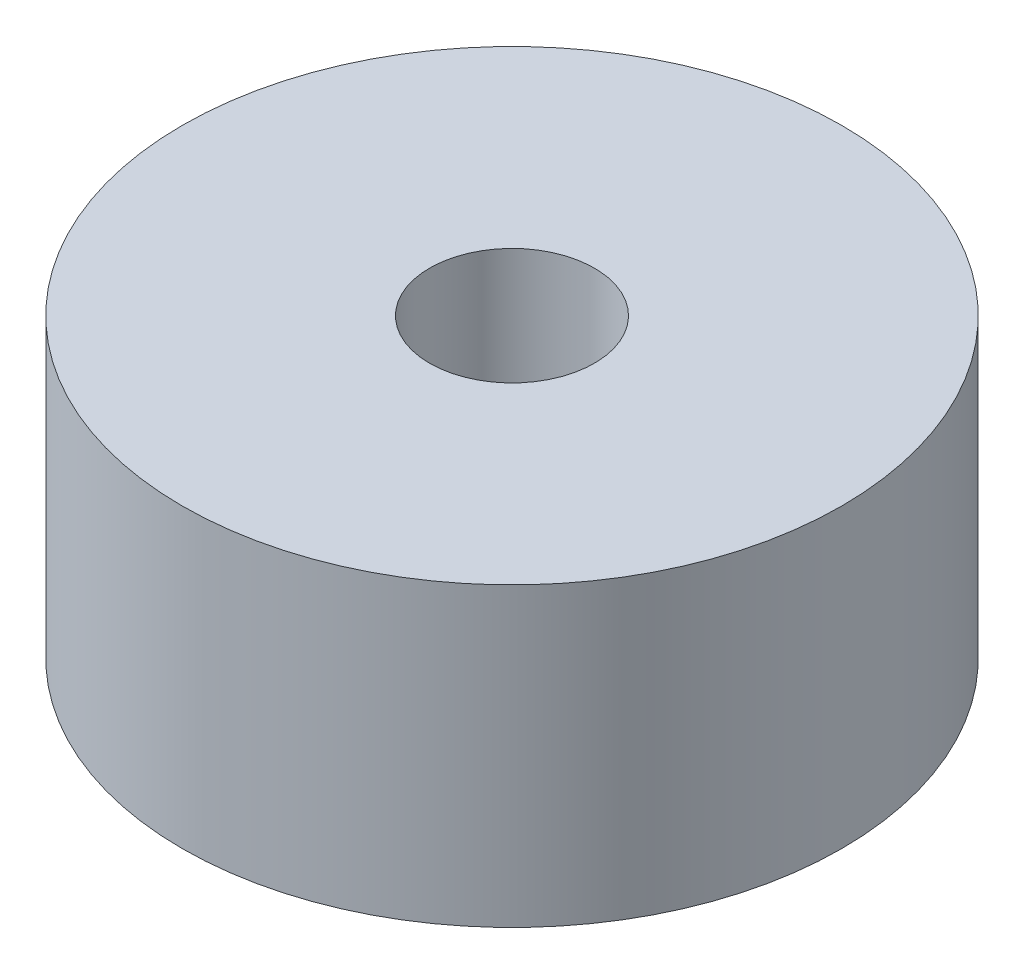
ISO-10303-21;
HEADER;
FILE_DESCRIPTION(('STEP AP214'),'2;1');
FILE_NAME('part.step','',(''),(''),'','','');
FILE_SCHEMA(('AUTOMOTIVE_DESIGN { 1 0 10303 214 1 1 1 1 }'));
ENDSEC;
DATA;
#1=APPLICATION_CONTEXT('core data for automotive mechanical design processes');
#2=APPLICATION_PROTOCOL_DEFINITION('international standard','automotive_design',2000,#1);
#3=PRODUCT_CONTEXT('',#1,'mechanical');
#4=PRODUCT('Part','Part','',(#3));
#5=PRODUCT_RELATED_PRODUCT_CATEGORY('part','',(#4));
#6=PRODUCT_DEFINITION_FORMATION('','',#4);
#7=PRODUCT_DEFINITION_CONTEXT('part definition',#1,'design');
#8=PRODUCT_DEFINITION('design','',#6,#7);
#9=PRODUCT_DEFINITION_SHAPE('','',#8);
#10=(LENGTH_UNIT() NAMED_UNIT(*) SI_UNIT(.MILLI.,.METRE.));
#11=(NAMED_UNIT(*) PLANE_ANGLE_UNIT() SI_UNIT($,.RADIAN.));
#12=(NAMED_UNIT(*) SI_UNIT($,.STERADIAN.) SOLID_ANGLE_UNIT());
#13=UNCERTAINTY_MEASURE_WITH_UNIT(LENGTH_MEASURE(1.E-05),#10,'distance_accuracy_value','');
#14=(GEOMETRIC_REPRESENTATION_CONTEXT(3) GLOBAL_UNCERTAINTY_ASSIGNED_CONTEXT((#13)) GLOBAL_UNIT_ASSIGNED_CONTEXT((#10,
#11,#12)) REPRESENTATION_CONTEXT('',''));
#15=CARTESIAN_POINT('',(0.,0.,0.));
#16=DIRECTION('',(0.,0.,1.));
#17=DIRECTION('',(1.,0.,0.));
#18=AXIS2_PLACEMENT_3D('',#15,#16,#17);
#19=CARTESIAN_POINT('',(0.,18.,0.));
#20=DIRECTION('',(0.,-1.,0.));
#21=DIRECTION('',(0.,0.,-1.));
#22=AXIS2_PLACEMENT_3D('',#19,#20,#21);
#23=CYLINDRICAL_SURFACE('',#22,20.);
#24=CARTESIAN_POINT('',(0.,18.,0.));
#25=DIRECTION('',(0.,1.,0.));
#26=DIRECTION('',(0.,0.,1.));
#27=AXIS2_PLACEMENT_3D('',#24,#25,#26);
#28=CIRCLE('',#27,20.);
#29=CARTESIAN_POINT('',(0.,18.,20.));
#30=VERTEX_POINT('',#29);
#31=EDGE_CURVE('E10',#30,#30,#28,.T.);
#32=ORIENTED_EDGE('',*,*,#31,.F.);
#33=EDGE_LOOP('',(#32));
#34=FACE_BOUND('',#33,.T.);
#35=CARTESIAN_POINT('',(0.,0.,0.));
#36=DIRECTION('',(0.,1.,0.));
#37=DIRECTION('',(0.,0.,1.));
#38=AXIS2_PLACEMENT_3D('',#35,#36,#37);
#39=CIRCLE('',#38,20.);
#40=CARTESIAN_POINT('',(0.,0.,20.));
#41=VERTEX_POINT('',#40);
#42=EDGE_CURVE('E38',#41,#41,#39,.T.);
#43=ORIENTED_EDGE('',*,*,#42,.T.);
#44=EDGE_LOOP('',(#43));
#45=FACE_BOUND('',#44,.T.);
#46=ADVANCED_FACE('F35',(#34,#45),#23,.T.);
#47=CARTESIAN_POINT('',(0.,18.,0.));
#48=DIRECTION('',(0.,1.,0.));
#49=DIRECTION('',(0.,0.,1.));
#50=AXIS2_PLACEMENT_3D('',#47,#48,#49);
#51=PLANE('',#50);
#52=CARTESIAN_POINT('',(0.,18.,0.));
#53=DIRECTION('',(0.,1.,0.));
#54=DIRECTION('',(0.,0.,1.));
#55=AXIS2_PLACEMENT_3D('',#52,#53,#54);
#56=CIRCLE('',#55,5.);
#57=CARTESIAN_POINT('',(0.,18.,5.));
#58=VERTEX_POINT('',#57);
#59=EDGE_CURVE('E47',#58,#58,#56,.T.);
#60=ORIENTED_EDGE('',*,*,#59,.F.);
#61=EDGE_LOOP('',(#60));
#62=FACE_BOUND('',#61,.T.);
#63=ORIENTED_EDGE('',*,*,#31,.T.);
#64=EDGE_LOOP('',(#63));
#65=FACE_BOUND('',#64,.T.);
#66=ADVANCED_FACE('F83',(#62,#65),#51,.T.);
#67=CARTESIAN_POINT('',(0.,0.,0.));
#68=DIRECTION('',(0.,1.,0.));
#69=DIRECTION('',(0.,0.,1.));
#70=AXIS2_PLACEMENT_3D('',#67,#68,#69);
#71=PLANE('',#70);
#72=CARTESIAN_POINT('',(-11.,0.,-11.));
#73=DIRECTION('',(0.,-1.,0.));
#74=DIRECTION('',(0.,0.,-1.));
#75=AXIS2_PLACEMENT_3D('',#72,#73,#74);
#76=CIRCLE('',#75,1.5);
#77=CARTESIAN_POINT('',(-11.,0.,-12.5));
#78=VERTEX_POINT('',#77);
#79=EDGE_CURVE('E56',#78,#78,#76,.T.);
#80=ORIENTED_EDGE('',*,*,#79,.F.);
#81=EDGE_LOOP('',(#80));
#82=FACE_BOUND('',#81,.T.);
#83=CARTESIAN_POINT('',(11.,0.,11.));
#84=DIRECTION('',(0.,-1.,0.));
#85=DIRECTION('',(0.,0.,-1.));
#86=AXIS2_PLACEMENT_3D('',#83,#84,#85);
#87=CIRCLE('',#86,1.5);
#88=CARTESIAN_POINT('',(11.,0.,9.5));
#89=VERTEX_POINT('',#88);
#90=EDGE_CURVE('E62',#89,#89,#87,.T.);
#91=ORIENTED_EDGE('',*,*,#90,.F.);
#92=EDGE_LOOP('',(#91));
#93=FACE_BOUND('',#92,.T.);
#94=CARTESIAN_POINT('',(-11.,0.,11.));
#95=DIRECTION('',(0.,-1.,0.));
#96=DIRECTION('',(0.,0.,-1.));
#97=AXIS2_PLACEMENT_3D('',#94,#95,#96);
#98=CIRCLE('',#97,1.5);
#99=CARTESIAN_POINT('',(-11.,0.,9.5));
#100=VERTEX_POINT('',#99);
#101=EDGE_CURVE('E63',#100,#100,#98,.T.);
#102=ORIENTED_EDGE('',*,*,#101,.F.);
#103=EDGE_LOOP('',(#102));
#104=FACE_BOUND('',#103,.T.);
#105=CARTESIAN_POINT('',(11.,0.,-11.));
#106=DIRECTION('',(0.,-1.,0.));
#107=DIRECTION('',(0.,0.,-1.));
#108=AXIS2_PLACEMENT_3D('',#105,#106,#107);
#109=CIRCLE('',#108,1.5);
#110=CARTESIAN_POINT('',(11.,0.,-12.5));
#111=VERTEX_POINT('',#110);
#112=EDGE_CURVE('E53',#111,#111,#109,.T.);
#113=ORIENTED_EDGE('',*,*,#112,.F.);
#114=EDGE_LOOP('',(#113));
#115=FACE_BOUND('',#114,.T.);
#116=ORIENTED_EDGE('',*,*,#42,.F.);
#117=EDGE_LOOP('',(#116));
#118=FACE_BOUND('',#117,.T.);
#119=ADVANCED_FACE('F79',(#82,#93,#104,#115,#118),#71,.F.);
#120=CARTESIAN_POINT('',(0.,8.,0.));
#121=DIRECTION('',(0.,1.,0.));
#122=DIRECTION('',(0.,0.,1.));
#123=AXIS2_PLACEMENT_3D('',#120,#121,#122);
#124=CYLINDRICAL_SURFACE('',#123,5.);
#125=CARTESIAN_POINT('',(0.,8.,0.));
#126=DIRECTION('',(0.,1.,0.));
#127=DIRECTION('',(0.,0.,1.));
#128=AXIS2_PLACEMENT_3D('',#125,#126,#127);
#129=CIRCLE('',#128,5.);
#130=CARTESIAN_POINT('',(0.,8.,5.));
#131=VERTEX_POINT('',#130);
#132=EDGE_CURVE('E45',#131,#131,#129,.T.);
#133=ORIENTED_EDGE('',*,*,#132,.F.);
#134=EDGE_LOOP('',(#133));
#135=FACE_BOUND('',#134,.T.);
#136=ORIENTED_EDGE('',*,*,#59,.T.);
#137=EDGE_LOOP('',(#136));
#138=FACE_BOUND('',#137,.T.);
#139=ADVANCED_FACE('F82',(#135,#138),#124,.F.);
#140=CARTESIAN_POINT('',(0.,8.,0.));
#141=DIRECTION('',(0.,1.,0.));
#142=DIRECTION('',(0.,0.,1.));
#143=AXIS2_PLACEMENT_3D('',#140,#141,#142);
#144=PLANE('',#143);
#145=ORIENTED_EDGE('',*,*,#132,.T.);
#146=EDGE_LOOP('',(#145));
#147=FACE_BOUND('',#146,.T.);
#148=ADVANCED_FACE('F103',(#147),#144,.T.);
#149=CARTESIAN_POINT('',(11.,8.,-11.));
#150=DIRECTION('',(0.,-1.,0.));
#151=DIRECTION('',(0.,0.,-1.));
#152=AXIS2_PLACEMENT_3D('',#149,#150,#151);
#153=CYLINDRICAL_SURFACE('',#152,1.5);
#154=CARTESIAN_POINT('',(11.,8.,-11.));
#155=DIRECTION('',(0.,-1.,0.));
#156=DIRECTION('',(0.,0.,-1.));
#157=AXIS2_PLACEMENT_3D('',#154,#155,#156);
#158=CIRCLE('',#157,1.5);
#159=CARTESIAN_POINT('',(11.,8.,-12.5));
#160=VERTEX_POINT('',#159);
#161=EDGE_CURVE('E50',#160,#160,#158,.T.);
#162=ORIENTED_EDGE('',*,*,#161,.F.);
#163=EDGE_LOOP('',(#162));
#164=FACE_BOUND('',#163,.T.);
#165=ORIENTED_EDGE('',*,*,#112,.T.);
#166=EDGE_LOOP('',(#165));
#167=FACE_BOUND('',#166,.T.);
#168=ADVANCED_FACE('F107',(#164,#167),#153,.F.);
#169=CARTESIAN_POINT('',(11.,8.,-11.));
#170=DIRECTION('',(0.,-1.,0.));
#171=DIRECTION('',(0.,0.,-1.));
#172=AXIS2_PLACEMENT_3D('',#169,#170,#171);
#173=PLANE('',#172);
#174=ORIENTED_EDGE('',*,*,#161,.T.);
#175=EDGE_LOOP('',(#174));
#176=FACE_BOUND('',#175,.T.);
#177=ADVANCED_FACE('F111',(#176),#173,.T.);
#178=CARTESIAN_POINT('',(-11.,8.,11.));
#179=DIRECTION('',(0.,-1.,0.));
#180=DIRECTION('',(0.,0.,-1.));
#181=AXIS2_PLACEMENT_3D('',#178,#179,#180);
#182=CYLINDRICAL_SURFACE('',#181,1.5);
#183=CARTESIAN_POINT('',(-11.,8.,11.));
#184=DIRECTION('',(0.,-1.,0.));
#185=DIRECTION('',(0.,0.,-1.));
#186=AXIS2_PLACEMENT_3D('',#183,#184,#185);
#187=CIRCLE('',#186,1.5);
#188=CARTESIAN_POINT('',(-11.,8.,9.5));
#189=VERTEX_POINT('',#188);
#190=EDGE_CURVE('E71',#189,#189,#187,.T.);
#191=ORIENTED_EDGE('',*,*,#190,.F.);
#192=EDGE_LOOP('',(#191));
#193=FACE_BOUND('',#192,.T.);
#194=ORIENTED_EDGE('',*,*,#101,.T.);
#195=EDGE_LOOP('',(#194));
#196=FACE_BOUND('',#195,.T.);
#197=ADVANCED_FACE('F77',(#193,#196),#182,.F.);
#198=CARTESIAN_POINT('',(-11.,8.,11.));
#199=DIRECTION('',(0.,-1.,0.));
#200=DIRECTION('',(0.,0.,-1.));
#201=AXIS2_PLACEMENT_3D('',#198,#199,#200);
#202=PLANE('',#201);
#203=ORIENTED_EDGE('',*,*,#190,.T.);
#204=EDGE_LOOP('',(#203));
#205=FACE_BOUND('',#204,.T.);
#206=ADVANCED_FACE('F124',(#205),#202,.T.);
#207=CARTESIAN_POINT('',(11.,8.,11.));
#208=DIRECTION('',(0.,-1.,0.));
#209=DIRECTION('',(0.,0.,-1.));
#210=AXIS2_PLACEMENT_3D('',#207,#208,#209);
#211=CYLINDRICAL_SURFACE('',#210,1.5);
#212=CARTESIAN_POINT('',(11.,8.,11.));
#213=DIRECTION('',(0.,-1.,0.));
#214=DIRECTION('',(0.,0.,-1.));
#215=AXIS2_PLACEMENT_3D('',#212,#213,#214);
#216=CIRCLE('',#215,1.5);
#217=CARTESIAN_POINT('',(11.,8.,9.5));
#218=VERTEX_POINT('',#217);
#219=EDGE_CURVE('E59',#218,#218,#216,.T.);
#220=ORIENTED_EDGE('',*,*,#219,.F.);
#221=EDGE_LOOP('',(#220));
#222=FACE_BOUND('',#221,.T.);
#223=ORIENTED_EDGE('',*,*,#90,.T.);
#224=EDGE_LOOP('',(#223));
#225=FACE_BOUND('',#224,.T.);
#226=ADVANCED_FACE('F120',(#222,#225),#211,.F.);
#227=CARTESIAN_POINT('',(11.,8.,11.));
#228=DIRECTION('',(0.,-1.,0.));
#229=DIRECTION('',(0.,0.,-1.));
#230=AXIS2_PLACEMENT_3D('',#227,#228,#229);
#231=PLANE('',#230);
#232=ORIENTED_EDGE('',*,*,#219,.T.);
#233=EDGE_LOOP('',(#232));
#234=FACE_BOUND('',#233,.T.);
#235=ADVANCED_FACE('F116',(#234),#231,.T.);
#236=CARTESIAN_POINT('',(-11.,8.,-11.));
#237=DIRECTION('',(0.,-1.,0.));
#238=DIRECTION('',(0.,0.,-1.));
#239=AXIS2_PLACEMENT_3D('',#236,#237,#238);
#240=CYLINDRICAL_SURFACE('',#239,1.5);
#241=CARTESIAN_POINT('',(-11.,8.,-11.));
#242=DIRECTION('',(0.,-1.,0.));
#243=DIRECTION('',(0.,0.,-1.));
#244=AXIS2_PLACEMENT_3D('',#241,#242,#243);
#245=CIRCLE('',#244,1.5);
#246=CARTESIAN_POINT('',(-11.,8.,-12.5));
#247=VERTEX_POINT('',#246);
#248=EDGE_CURVE('E66',#247,#247,#245,.T.);
#249=ORIENTED_EDGE('',*,*,#248,.F.);
#250=EDGE_LOOP('',(#249));
#251=FACE_BOUND('',#250,.T.);
#252=ORIENTED_EDGE('',*,*,#79,.T.);
#253=EDGE_LOOP('',(#252));
#254=FACE_BOUND('',#253,.T.);
#255=ADVANCED_FACE('F119',(#251,#254),#240,.F.);
#256=CARTESIAN_POINT('',(-11.,8.,-11.));
#257=DIRECTION('',(0.,-1.,0.));
#258=DIRECTION('',(0.,0.,-1.));
#259=AXIS2_PLACEMENT_3D('',#256,#257,#258);
#260=PLANE('',#259);
#261=ORIENTED_EDGE('',*,*,#248,.T.);
#262=EDGE_LOOP('',(#261));
#263=FACE_BOUND('',#262,.T.);
#264=ADVANCED_FACE('F126',(#263),#260,.T.);
#265=CLOSED_SHELL('',(#46,#66,#119,#139,#148,#168,#177,#197,#206,#226,#235,#255,#264));
#266=MANIFOLD_SOLID_BREP('B2',#265);
#267=ADVANCED_BREP_SHAPE_REPRESENTATION('',(#18,#266),#14);
#268=SHAPE_DEFINITION_REPRESENTATION(#9,#267);
ENDSEC;
END-ISO-10303-21;
